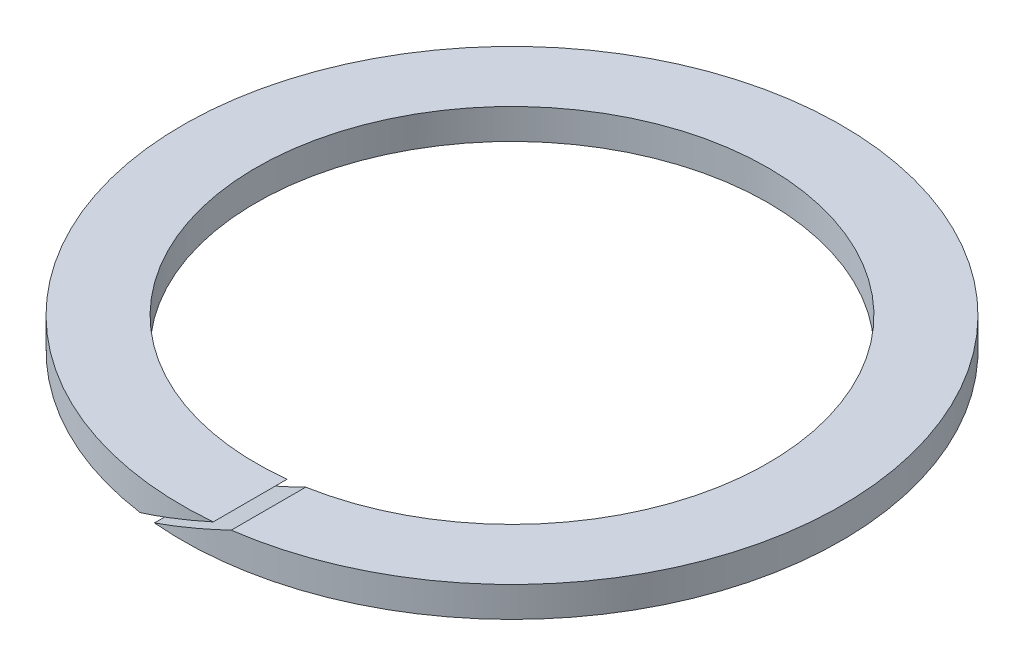
ISO-10303-21;
HEADER;
FILE_DESCRIPTION(('STEP AP214'),'2;1');
FILE_NAME('part.step','',(''),(''),'','','');
FILE_SCHEMA(('AUTOMOTIVE_DESIGN { 1 0 10303 214 1 1 1 1 }'));
ENDSEC;
DATA;
#1=APPLICATION_CONTEXT('core data for automotive mechanical design processes');
#2=APPLICATION_PROTOCOL_DEFINITION('international standard','automotive_design',2000,#1);
#3=PRODUCT_CONTEXT('',#1,'mechanical');
#4=PRODUCT('Part','Part','',(#3));
#5=PRODUCT_RELATED_PRODUCT_CATEGORY('part','',(#4));
#6=PRODUCT_DEFINITION_FORMATION('','',#4);
#7=PRODUCT_DEFINITION_CONTEXT('part definition',#1,'design');
#8=PRODUCT_DEFINITION('design','',#6,#7);
#9=PRODUCT_DEFINITION_SHAPE('','',#8);
#10=(LENGTH_UNIT() NAMED_UNIT(*) SI_UNIT(.MILLI.,.METRE.));
#11=(NAMED_UNIT(*) PLANE_ANGLE_UNIT() SI_UNIT($,.RADIAN.));
#12=(NAMED_UNIT(*) SI_UNIT($,.STERADIAN.) SOLID_ANGLE_UNIT());
#13=UNCERTAINTY_MEASURE_WITH_UNIT(LENGTH_MEASURE(1.E-05),#10,'distance_accuracy_value','');
#14=(GEOMETRIC_REPRESENTATION_CONTEXT(3) GLOBAL_UNCERTAINTY_ASSIGNED_CONTEXT((#13)) GLOBAL_UNIT_ASSIGNED_CONTEXT((#10,
#11,#12)) REPRESENTATION_CONTEXT('',''));
#15=CARTESIAN_POINT('',(0.,0.,0.));
#16=DIRECTION('',(0.,0.,1.));
#17=DIRECTION('',(1.,0.,0.));
#18=AXIS2_PLACEMENT_3D('',#15,#16,#17);
#19=CARTESIAN_POINT('',(0.,-0.6223,0.));
#20=DIRECTION('',(0.,1.,0.));
#21=DIRECTION('',(0.,0.,1.));
#22=AXIS2_PLACEMENT_3D('',#19,#20,#21);
#23=CYLINDRICAL_SURFACE('',#22,13.5382);
#24=CARTESIAN_POINT('',(0.,-0.6223,0.));
#25=DIRECTION('',(0.,1.,0.));
#26=DIRECTION('',(0.,0.,1.));
#27=AXIS2_PLACEMENT_3D('',#24,#25,#26);
#28=CIRCLE('',#27,13.5382);
#29=CARTESIAN_POINT('',(-1.20800466582949,-0.6223,13.4841975648288));
#30=VERTEX_POINT('',#29);
#31=CARTESIAN_POINT('',(-1.87248843193243,-0.6223,13.40808138073));
#32=VERTEX_POINT('',#31);
#33=EDGE_CURVE('E84',#30,#32,#28,.T.);
#34=ORIENTED_EDGE('',*,*,#33,.T.);
#35=CARTESIAN_POINT('',(0.,0.134234434073653,0.));
#36=DIRECTION('',(0.374606593415913,-0.927183854566787,0.));
#37=DIRECTION('',(0.927183854566787,0.374606593415913,0.));
#38=AXIS2_PLACEMENT_3D('',#35,#36,#37);
#39=ELLIPSE('',#38,14.6014190533177,13.5382);
#40=CARTESIAN_POINT('',(1.20800466582948,0.6223,13.4841975648288));
#41=VERTEX_POINT('',#40);
#42=EDGE_CURVE('E96',#32,#41,#39,.F.);
#43=ORIENTED_EDGE('',*,*,#42,.T.);
#44=CARTESIAN_POINT('',(0.,0.6223,0.));
#45=DIRECTION('',(0.,1.,0.));
#46=DIRECTION('',(0.,0.,1.));
#47=AXIS2_PLACEMENT_3D('',#44,#45,#46);
#48=CIRCLE('',#47,13.5382);
#49=CARTESIAN_POINT('',(1.87248843193243,0.6223,13.40808138073));
#50=VERTEX_POINT('',#49);
#51=EDGE_CURVE('E95',#50,#41,#48,.T.);
#52=ORIENTED_EDGE('',*,*,#51,.F.);
#53=CARTESIAN_POINT('',(0.,-0.134234434073652,0.));
#54=DIRECTION('',(-0.374606593415913,0.927183854566787,0.));
#55=DIRECTION('',(0.927183854566787,0.374606593415913,0.));
#56=AXIS2_PLACEMENT_3D('',#53,#54,#55);
#57=ELLIPSE('',#56,14.6014190533177,13.5382);
#58=EDGE_CURVE('E60',#50,#30,#57,.F.);
#59=ORIENTED_EDGE('',*,*,#58,.T.);
#60=EDGE_LOOP('',(#34,#43,#52,#59));
#61=FACE_BOUND('',#60,.T.);
#62=ADVANCED_FACE('F39',(#61),#23,.T.);
#63=CARTESIAN_POINT('',(0.,-0.6223,0.));
#64=DIRECTION('',(0.,1.,0.));
#65=DIRECTION('',(0.,0.,1.));
#66=AXIS2_PLACEMENT_3D('',#63,#64,#65);
#67=PLANE('',#66);
#68=DIRECTION('',(0.,0.,-1.));
#69=VECTOR('',#68,1.);
#70=CARTESIAN_POINT('',(-1.87248843193243,-0.6223,0.));
#71=LINE('',#70,#69);
#72=CARTESIAN_POINT('',(-1.87248843193243,-0.6223,10.347542241145));
#73=VERTEX_POINT('',#72);
#74=EDGE_CURVE('E99',#32,#73,#71,.T.);
#75=ORIENTED_EDGE('',*,*,#74,.F.);
#76=ORIENTED_EDGE('',*,*,#33,.F.);
#77=DIRECTION('',(0.,0.,1.));
#78=VECTOR('',#77,1.);
#79=CARTESIAN_POINT('',(-1.20800466582949,-0.6223,0.));
#80=LINE('',#79,#78);
#81=CARTESIAN_POINT('',(-1.20800466582949,-0.6223,10.4459833470734));
#82=VERTEX_POINT('',#81);
#83=EDGE_CURVE('E92',#82,#30,#80,.T.);
#84=ORIENTED_EDGE('',*,*,#83,.F.);
#85=CARTESIAN_POINT('',(0.,-0.6223,0.));
#86=DIRECTION('',(0.,1.,0.));
#87=DIRECTION('',(0.,0.,1.));
#88=AXIS2_PLACEMENT_3D('',#85,#86,#87);
#89=CIRCLE('',#88,10.5156);
#90=EDGE_CURVE('E91',#82,#73,#89,.T.);
#91=ORIENTED_EDGE('',*,*,#90,.T.);
#92=EDGE_LOOP('',(#75,#76,#84,#91));
#93=FACE_BOUND('',#92,.T.);
#94=ADVANCED_FACE('F109',(#93),#67,.F.);
#95=CARTESIAN_POINT('',(0.,-0.6223,0.));
#96=DIRECTION('',(0.,1.,0.));
#97=DIRECTION('',(0.,0.,1.));
#98=AXIS2_PLACEMENT_3D('',#95,#96,#97);
#99=CYLINDRICAL_SURFACE('',#98,10.5156);
#100=CARTESIAN_POINT('',(0.,0.134234434073653,0.));
#101=DIRECTION('',(0.374606593415913,-0.927183854566787,0.));
#102=DIRECTION('',(0.927183854566787,0.374606593415913,0.));
#103=AXIS2_PLACEMENT_3D('',#100,#101,#102);
#104=ELLIPSE('',#103,11.3414399401004,10.5156);
#105=CARTESIAN_POINT('',(1.20800466582948,0.6223,10.4459833470734));
#106=VERTEX_POINT('',#105);
#107=EDGE_CURVE('E53',#73,#106,#104,.F.);
#108=ORIENTED_EDGE('',*,*,#107,.F.);
#109=ORIENTED_EDGE('',*,*,#90,.F.);
#110=CARTESIAN_POINT('',(0.,-0.134234434073652,0.));
#111=DIRECTION('',(-0.374606593415913,0.927183854566787,0.));
#112=DIRECTION('',(0.927183854566787,0.374606593415913,0.));
#113=AXIS2_PLACEMENT_3D('',#110,#111,#112);
#114=ELLIPSE('',#113,11.3414399401004,10.5156);
#115=CARTESIAN_POINT('',(1.87248843193243,0.6223,10.347542241145));
#116=VERTEX_POINT('',#115);
#117=EDGE_CURVE('E78',#116,#82,#114,.F.);
#118=ORIENTED_EDGE('',*,*,#117,.F.);
#119=CARTESIAN_POINT('',(0.,0.6223,0.));
#120=DIRECTION('',(0.,1.,0.));
#121=DIRECTION('',(0.,0.,1.));
#122=AXIS2_PLACEMENT_3D('',#119,#120,#121);
#123=CIRCLE('',#122,10.5156);
#124=EDGE_CURVE('E89',#116,#106,#123,.T.);
#125=ORIENTED_EDGE('',*,*,#124,.T.);
#126=EDGE_LOOP('',(#108,#109,#118,#125));
#127=FACE_BOUND('',#126,.T.);
#128=ADVANCED_FACE('F88',(#127),#99,.F.);
#129=CARTESIAN_POINT('',(0.,0.6223,0.));
#130=DIRECTION('',(0.,1.,0.));
#131=DIRECTION('',(0.,0.,1.));
#132=AXIS2_PLACEMENT_3D('',#129,#130,#131);
#133=PLANE('',#132);
#134=ORIENTED_EDGE('',*,*,#51,.T.);
#135=DIRECTION('',(0.,0.,-1.));
#136=VECTOR('',#135,1.);
#137=CARTESIAN_POINT('',(1.20800466582948,0.6223,0.));
#138=LINE('',#137,#136);
#139=EDGE_CURVE('E11',#41,#106,#138,.T.);
#140=ORIENTED_EDGE('',*,*,#139,.T.);
#141=ORIENTED_EDGE('',*,*,#124,.F.);
#142=DIRECTION('',(0.,0.,1.));
#143=VECTOR('',#142,1.);
#144=CARTESIAN_POINT('',(1.87248843193243,0.6223,0.));
#145=LINE('',#144,#143);
#146=EDGE_CURVE('E46',#116,#50,#145,.T.);
#147=ORIENTED_EDGE('',*,*,#146,.T.);
#148=EDGE_LOOP('',(#134,#140,#141,#147));
#149=FACE_BOUND('',#148,.T.);
#150=ADVANCED_FACE('F94',(#149),#133,.T.);
#151=CARTESIAN_POINT('',(2.93155610010111,1.05019111287423,13.5382));
#152=DIRECTION('',(-0.374606593415913,0.927183854566787,0.));
#153=DIRECTION('',(-0.927183854566787,-0.374606593415913,0.));
#154=AXIS2_PLACEMENT_3D('',#151,#152,#153);
#155=PLANE('',#154);
#156=ORIENTED_EDGE('',*,*,#146,.F.);
#157=ORIENTED_EDGE('',*,*,#117,.T.);
#158=ORIENTED_EDGE('',*,*,#83,.T.);
#159=ORIENTED_EDGE('',*,*,#58,.F.);
#160=EDGE_LOOP('',(#156,#157,#158,#159));
#161=FACE_BOUND('',#160,.T.);
#162=ADVANCED_FACE('F77',(#161),#155,.T.);
#163=CARTESIAN_POINT('',(2.83830902686802,1.280985717953,13.5382));
#164=DIRECTION('',(0.374606593415913,-0.927183854566787,0.));
#165=DIRECTION('',(0.927183854566787,0.374606593415913,0.));
#166=AXIS2_PLACEMENT_3D('',#163,#164,#165);
#167=PLANE('',#166);
#168=ORIENTED_EDGE('',*,*,#74,.T.);
#169=ORIENTED_EDGE('',*,*,#107,.T.);
#170=ORIENTED_EDGE('',*,*,#139,.F.);
#171=ORIENTED_EDGE('',*,*,#42,.F.);
#172=EDGE_LOOP('',(#168,#169,#170,#171));
#173=FACE_BOUND('',#172,.T.);
#174=ADVANCED_FACE('F113',(#173),#167,.T.);
#175=CLOSED_SHELL('',(#62,#94,#128,#150,#162,#174));
#176=MANIFOLD_SOLID_BREP('B2',#175);
#177=ADVANCED_BREP_SHAPE_REPRESENTATION('',(#18,#176),#14);
#178=SHAPE_DEFINITION_REPRESENTATION(#9,#177);
ENDSEC;
END-ISO-10303-21;
